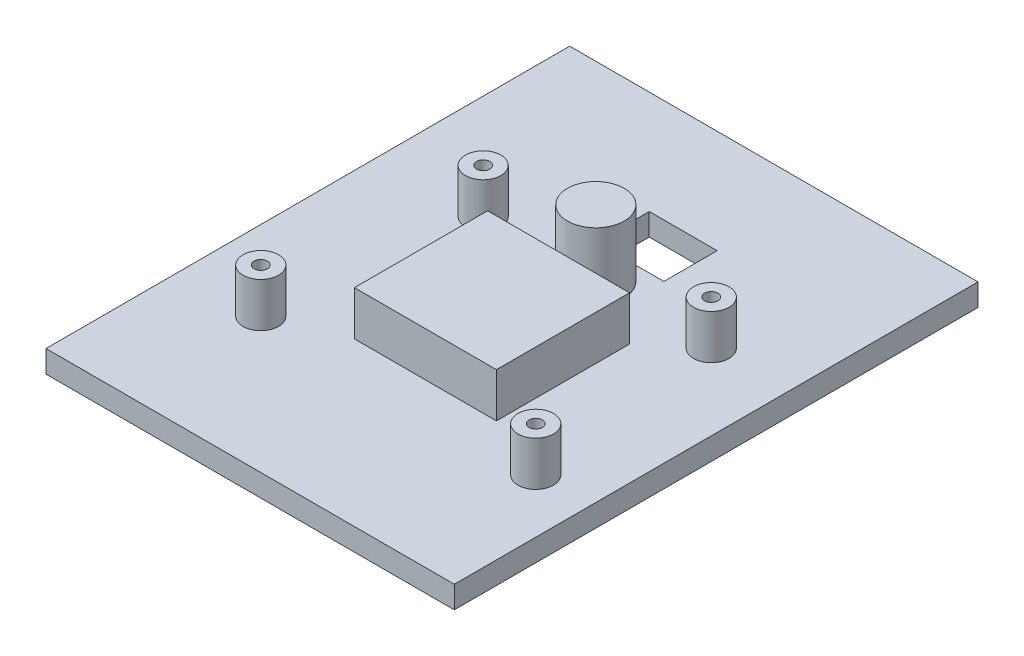
ISO-10303-21;
HEADER;
FILE_DESCRIPTION(('STEP AP214'),'2;1');
FILE_NAME('part.step','',(''),(''),'','','');
FILE_SCHEMA(('AUTOMOTIVE_DESIGN { 1 0 10303 214 1 1 1 1 }'));
ENDSEC;
DATA;
#1=APPLICATION_CONTEXT('core data for automotive mechanical design processes');
#2=APPLICATION_PROTOCOL_DEFINITION('international standard','automotive_design',2000,#1);
#3=PRODUCT_CONTEXT('',#1,'mechanical');
#4=PRODUCT('Part','Part','',(#3));
#5=PRODUCT_RELATED_PRODUCT_CATEGORY('part','',(#4));
#6=PRODUCT_DEFINITION_FORMATION('','',#4);
#7=PRODUCT_DEFINITION_CONTEXT('part definition',#1,'design');
#8=PRODUCT_DEFINITION('design','',#6,#7);
#9=PRODUCT_DEFINITION_SHAPE('','',#8);
#10=(LENGTH_UNIT() NAMED_UNIT(*) SI_UNIT(.MILLI.,.METRE.));
#11=(NAMED_UNIT(*) PLANE_ANGLE_UNIT() SI_UNIT($,.RADIAN.));
#12=(NAMED_UNIT(*) SI_UNIT($,.STERADIAN.) SOLID_ANGLE_UNIT());
#13=UNCERTAINTY_MEASURE_WITH_UNIT(LENGTH_MEASURE(1.E-05),#10,'distance_accuracy_value','');
#14=(GEOMETRIC_REPRESENTATION_CONTEXT(3) GLOBAL_UNCERTAINTY_ASSIGNED_CONTEXT((#13)) GLOBAL_UNIT_ASSIGNED_CONTEXT((#10,
#11,#12)) REPRESENTATION_CONTEXT('',''));
#15=CARTESIAN_POINT('',(0.,0.,0.));
#16=DIRECTION('',(0.,0.,1.));
#17=DIRECTION('',(1.,0.,0.));
#18=AXIS2_PLACEMENT_3D('',#15,#16,#17);
#19=CARTESIAN_POINT('',(-48.875,0.,0.));
#20=DIRECTION('',(1.,0.,0.));
#21=DIRECTION('',(0.,0.,-1.));
#22=AXIS2_PLACEMENT_3D('',#19,#20,#21);
#23=PLANE('',#22);
#24=DIRECTION('',(0.,-1.,0.));
#25=VECTOR('',#24,1.);
#26=CARTESIAN_POINT('',(-48.875,5.,-55.5));
#27=LINE('',#26,#25);
#28=CARTESIAN_POINT('',(-48.875,5.,-55.5));
#29=VERTEX_POINT('',#28);
#30=CARTESIAN_POINT('',(-48.875,0.,-55.5));
#31=VERTEX_POINT('',#30);
#32=EDGE_CURVE('E11',#29,#31,#27,.T.);
#33=ORIENTED_EDGE('',*,*,#32,.T.);
#34=DIRECTION('',(0.,0.,-1.));
#35=VECTOR('',#34,1.);
#36=CARTESIAN_POINT('',(-48.875,0.,0.));
#37=LINE('',#36,#35);
#38=CARTESIAN_POINT('',(-48.875,0.,62.5));
#39=VERTEX_POINT('',#38);
#40=EDGE_CURVE('E49',#39,#31,#37,.T.);
#41=ORIENTED_EDGE('',*,*,#40,.F.);
#42=DIRECTION('',(0.,-1.,0.));
#43=VECTOR('',#42,1.);
#44=CARTESIAN_POINT('',(-48.875,5.,62.5));
#45=LINE('',#44,#43);
#46=CARTESIAN_POINT('',(-48.875,5.,62.5));
#47=VERTEX_POINT('',#46);
#48=EDGE_CURVE('E219',#47,#39,#45,.T.);
#49=ORIENTED_EDGE('',*,*,#48,.F.);
#50=DIRECTION('',(0.,0.,-1.));
#51=VECTOR('',#50,1.);
#52=CARTESIAN_POINT('',(-48.875,5.,0.));
#53=LINE('',#52,#51);
#54=EDGE_CURVE('E42',#47,#29,#53,.T.);
#55=ORIENTED_EDGE('',*,*,#54,.T.);
#56=EDGE_LOOP('',(#33,#41,#49,#55));
#57=FACE_BOUND('',#56,.T.);
#58=ADVANCED_FACE('F35',(#57),#23,.F.);
#59=CARTESIAN_POINT('',(0.,20.,-12.51));
#60=DIRECTION('',(0.,1.,0.));
#61=DIRECTION('',(0.,0.,1.));
#62=AXIS2_PLACEMENT_3D('',#59,#60,#61);
#63=PLANE('',#62);
#64=CARTESIAN_POINT('',(0.,20.,-12.51));
#65=DIRECTION('',(0.,1.,0.));
#66=DIRECTION('',(0.,0.,1.));
#67=AXIS2_PLACEMENT_3D('',#64,#65,#66);
#68=CIRCLE('',#67,6.39);
#69=CARTESIAN_POINT('',(0.,20.,-6.12000000000001));
#70=VERTEX_POINT('',#69);
#71=EDGE_CURVE('E330',#70,#70,#68,.T.);
#72=ORIENTED_EDGE('',*,*,#71,.T.);
#73=EDGE_LOOP('',(#72));
#74=FACE_BOUND('',#73,.T.);
#75=ADVANCED_FACE('F247',(#74),#63,.T.);
#76=CARTESIAN_POINT('',(0.,15.,0.));
#77=DIRECTION('',(0.,1.,0.));
#78=DIRECTION('',(0.,0.,1.));
#79=AXIS2_PLACEMENT_3D('',#76,#77,#78);
#80=PLANE('',#79);
#81=DIRECTION('',(1.,0.,0.));
#82=VECTOR('',#81,1.);
#83=CARTESIAN_POINT('',(0.,15.,25.88));
#84=LINE('',#83,#82);
#85=CARTESIAN_POINT('',(-16.,15.,25.88));
#86=VERTEX_POINT('',#85);
#87=CARTESIAN_POINT('',(16.,15.,25.88));
#88=VERTEX_POINT('',#87);
#89=EDGE_CURVE('E135',#86,#88,#84,.T.);
#90=ORIENTED_EDGE('',*,*,#89,.T.);
#91=DIRECTION('',(0.,0.,-1.));
#92=VECTOR('',#91,1.);
#93=CARTESIAN_POINT('',(16.,15.,0.));
#94=LINE('',#93,#92);
#95=CARTESIAN_POINT('',(16.,15.,-4.12000000000001));
#96=VERTEX_POINT('',#95);
#97=EDGE_CURVE('E122',#88,#96,#94,.T.);
#98=ORIENTED_EDGE('',*,*,#97,.T.);
#99=DIRECTION('',(1.,0.,0.));
#100=VECTOR('',#99,1.);
#101=CARTESIAN_POINT('',(0.,15.,-4.12000000000001));
#102=LINE('',#101,#100);
#103=CARTESIAN_POINT('',(-16.,15.,-4.12000000000001));
#104=VERTEX_POINT('',#103);
#105=EDGE_CURVE('E134',#104,#96,#102,.T.);
#106=ORIENTED_EDGE('',*,*,#105,.F.);
#107=DIRECTION('',(0.,0.,-1.));
#108=VECTOR('',#107,1.);
#109=CARTESIAN_POINT('',(-16.,15.,0.));
#110=LINE('',#109,#108);
#111=EDGE_CURVE('E141',#86,#104,#110,.T.);
#112=ORIENTED_EDGE('',*,*,#111,.F.);
#113=EDGE_LOOP('',(#90,#98,#106,#112));
#114=FACE_BOUND('',#113,.T.);
#115=ADVANCED_FACE('F139',(#114),#80,.T.);
#116=CARTESIAN_POINT('',(0.,15.,0.));
#117=DIRECTION('',(0.,1.,0.));
#118=DIRECTION('',(0.,0.,1.));
#119=AXIS2_PLACEMENT_3D('',#116,#117,#118);
#120=PLANE('',#119);
#121=CARTESIAN_POINT('',(30.975,15.,32.));
#122=DIRECTION('',(0.,1.,0.));
#123=DIRECTION('',(0.,0.,1.));
#124=AXIS2_PLACEMENT_3D('',#121,#122,#123);
#125=CIRCLE('',#124,1.50000000000001);
#126=CARTESIAN_POINT('',(30.975,15.,33.5));
#127=VERTEX_POINT('',#126);
#128=EDGE_CURVE('E378',#127,#127,#125,.F.);
#129=ORIENTED_EDGE('',*,*,#128,.T.);
#130=EDGE_LOOP('',(#129));
#131=FACE_BOUND('',#130,.T.);
#132=CARTESIAN_POINT('',(30.975,15.,32.));
#133=DIRECTION('',(0.,1.,0.));
#134=DIRECTION('',(0.,0.,1.));
#135=AXIS2_PLACEMENT_3D('',#132,#133,#134);
#136=CIRCLE('',#135,4.);
#137=CARTESIAN_POINT('',(30.975,15.,36.));
#138=VERTEX_POINT('',#137);
#139=EDGE_CURVE('E381',#138,#138,#136,.T.);
#140=ORIENTED_EDGE('',*,*,#139,.T.);
#141=EDGE_LOOP('',(#140));
#142=FACE_BOUND('',#141,.T.);
#143=ADVANCED_FACE('F256',(#131,#142),#120,.T.);
#144=CARTESIAN_POINT('',(0.,15.,0.));
#145=DIRECTION('',(0.,1.,0.));
#146=DIRECTION('',(0.,0.,1.));
#147=AXIS2_PLACEMENT_3D('',#144,#145,#146);
#148=PLANE('',#147);
#149=CARTESIAN_POINT('',(-25.375,15.,-12.5));
#150=DIRECTION('',(0.,1.,0.));
#151=DIRECTION('',(0.,0.,1.));
#152=AXIS2_PLACEMENT_3D('',#149,#150,#151);
#153=CIRCLE('',#152,1.5);
#154=CARTESIAN_POINT('',(-25.375,15.,-11.));
#155=VERTEX_POINT('',#154);
#156=EDGE_CURVE('E324',#155,#155,#153,.F.);
#157=ORIENTED_EDGE('',*,*,#156,.T.);
#158=EDGE_LOOP('',(#157));
#159=FACE_BOUND('',#158,.T.);
#160=CARTESIAN_POINT('',(-25.375,15.,-12.5));
#161=DIRECTION('',(0.,1.,0.));
#162=DIRECTION('',(0.,0.,1.));
#163=AXIS2_PLACEMENT_3D('',#160,#161,#162);
#164=CIRCLE('',#163,4.);
#165=CARTESIAN_POINT('',(-25.375,15.,-8.5));
#166=VERTEX_POINT('',#165);
#167=EDGE_CURVE('E326',#166,#166,#164,.T.);
#168=ORIENTED_EDGE('',*,*,#167,.T.);
#169=EDGE_LOOP('',(#168));
#170=FACE_BOUND('',#169,.T.);
#171=ADVANCED_FACE('F406',(#159,#170),#148,.T.);
#172=CARTESIAN_POINT('',(0.,15.,0.));
#173=DIRECTION('',(0.,1.,0.));
#174=DIRECTION('',(0.,0.,1.));
#175=AXIS2_PLACEMENT_3D('',#172,#173,#174);
#176=PLANE('',#175);
#177=CARTESIAN_POINT('',(26.025,15.,-12.5));
#178=DIRECTION('',(0.,1.,0.));
#179=DIRECTION('',(0.,0.,1.));
#180=AXIS2_PLACEMENT_3D('',#177,#178,#179);
#181=CIRCLE('',#180,1.5);
#182=CARTESIAN_POINT('',(26.025,15.,-11.));
#183=VERTEX_POINT('',#182);
#184=EDGE_CURVE('E385',#183,#183,#181,.F.);
#185=ORIENTED_EDGE('',*,*,#184,.T.);
#186=EDGE_LOOP('',(#185));
#187=FACE_BOUND('',#186,.T.);
#188=CARTESIAN_POINT('',(26.025,15.,-12.5));
#189=DIRECTION('',(0.,1.,0.));
#190=DIRECTION('',(0.,0.,1.));
#191=AXIS2_PLACEMENT_3D('',#188,#189,#190);
#192=CIRCLE('',#191,4.);
#193=CARTESIAN_POINT('',(26.025,15.,-8.5));
#194=VERTEX_POINT('',#193);
#195=EDGE_CURVE('E333',#194,#194,#192,.T.);
#196=ORIENTED_EDGE('',*,*,#195,.T.);
#197=EDGE_LOOP('',(#196));
#198=FACE_BOUND('',#197,.T.);
#199=ADVANCED_FACE('F390',(#187,#198),#176,.T.);
#200=CARTESIAN_POINT('',(0.,15.,0.));
#201=DIRECTION('',(0.,1.,0.));
#202=DIRECTION('',(0.,0.,1.));
#203=AXIS2_PLACEMENT_3D('',#200,#201,#202);
#204=PLANE('',#203);
#205=CARTESIAN_POINT('',(-30.975,15.,32.));
#206=DIRECTION('',(0.,1.,0.));
#207=DIRECTION('',(0.,0.,1.));
#208=AXIS2_PLACEMENT_3D('',#205,#206,#207);
#209=CIRCLE('',#208,1.5);
#210=CARTESIAN_POINT('',(-30.975,15.,33.5));
#211=VERTEX_POINT('',#210);
#212=EDGE_CURVE('E371',#211,#211,#209,.F.);
#213=ORIENTED_EDGE('',*,*,#212,.T.);
#214=EDGE_LOOP('',(#213));
#215=FACE_BOUND('',#214,.T.);
#216=CARTESIAN_POINT('',(-30.975,15.,32.));
#217=DIRECTION('',(0.,1.,0.));
#218=DIRECTION('',(0.,0.,1.));
#219=AXIS2_PLACEMENT_3D('',#216,#217,#218);
#220=CIRCLE('',#219,4.);
#221=CARTESIAN_POINT('',(-30.975,15.,36.));
#222=VERTEX_POINT('',#221);
#223=EDGE_CURVE('E374',#222,#222,#220,.T.);
#224=ORIENTED_EDGE('',*,*,#223,.T.);
#225=EDGE_LOOP('',(#224));
#226=FACE_BOUND('',#225,.T.);
#227=ADVANCED_FACE('F412',(#215,#226),#204,.T.);
#228=CARTESIAN_POINT('',(-30.975,15.,32.));
#229=DIRECTION('',(0.,-1.,0.));
#230=DIRECTION('',(0.,0.,-1.));
#231=AXIS2_PLACEMENT_3D('',#228,#229,#230);
#232=CYLINDRICAL_SURFACE('',#231,4.);
#233=ORIENTED_EDGE('',*,*,#223,.F.);
#234=EDGE_LOOP('',(#233));
#235=FACE_BOUND('',#234,.T.);
#236=CARTESIAN_POINT('',(-30.975,5.,32.));
#237=DIRECTION('',(0.,1.,0.));
#238=DIRECTION('',(0.,0.,1.));
#239=AXIS2_PLACEMENT_3D('',#236,#237,#238);
#240=CIRCLE('',#239,4.);
#241=CARTESIAN_POINT('',(-30.975,5.,36.));
#242=VERTEX_POINT('',#241);
#243=EDGE_CURVE('E369',#242,#242,#240,.T.);
#244=ORIENTED_EDGE('',*,*,#243,.T.);
#245=EDGE_LOOP('',(#244));
#246=FACE_BOUND('',#245,.T.);
#247=ADVANCED_FACE('F402',(#235,#246),#232,.T.);
#248=CARTESIAN_POINT('',(30.975,15.,32.));
#249=DIRECTION('',(0.,-1.,0.));
#250=DIRECTION('',(0.,0.,-1.));
#251=AXIS2_PLACEMENT_3D('',#248,#249,#250);
#252=CYLINDRICAL_SURFACE('',#251,4.);
#253=ORIENTED_EDGE('',*,*,#139,.F.);
#254=EDGE_LOOP('',(#253));
#255=FACE_BOUND('',#254,.T.);
#256=CARTESIAN_POINT('',(30.975,5.,32.));
#257=DIRECTION('',(0.,1.,0.));
#258=DIRECTION('',(0.,0.,1.));
#259=AXIS2_PLACEMENT_3D('',#256,#257,#258);
#260=CIRCLE('',#259,4.);
#261=CARTESIAN_POINT('',(30.975,5.,36.));
#262=VERTEX_POINT('',#261);
#263=EDGE_CURVE('E366',#262,#262,#260,.T.);
#264=ORIENTED_EDGE('',*,*,#263,.T.);
#265=EDGE_LOOP('',(#264));
#266=FACE_BOUND('',#265,.T.);
#267=ADVANCED_FACE('F395',(#255,#266),#252,.T.);
#268=CARTESIAN_POINT('',(26.025,15.,-12.5));
#269=DIRECTION('',(0.,-1.,0.));
#270=DIRECTION('',(0.,0.,-1.));
#271=AXIS2_PLACEMENT_3D('',#268,#269,#270);
#272=CYLINDRICAL_SURFACE('',#271,4.);
#273=ORIENTED_EDGE('',*,*,#195,.F.);
#274=EDGE_LOOP('',(#273));
#275=FACE_BOUND('',#274,.T.);
#276=CARTESIAN_POINT('',(26.025,5.,-12.5));
#277=DIRECTION('',(0.,1.,0.));
#278=DIRECTION('',(0.,0.,1.));
#279=AXIS2_PLACEMENT_3D('',#276,#277,#278);
#280=CIRCLE('',#279,4.);
#281=CARTESIAN_POINT('',(26.025,5.,-8.5));
#282=VERTEX_POINT('',#281);
#283=EDGE_CURVE('E336',#282,#282,#280,.T.);
#284=ORIENTED_EDGE('',*,*,#283,.T.);
#285=EDGE_LOOP('',(#284));
#286=FACE_BOUND('',#285,.T.);
#287=ADVANCED_FACE('F392',(#275,#286),#272,.T.);
#288=CARTESIAN_POINT('',(-25.375,15.,-12.5));
#289=DIRECTION('',(0.,-1.,0.));
#290=DIRECTION('',(0.,0.,-1.));
#291=AXIS2_PLACEMENT_3D('',#288,#289,#290);
#292=CYLINDRICAL_SURFACE('',#291,4.);
#293=ORIENTED_EDGE('',*,*,#167,.F.);
#294=EDGE_LOOP('',(#293));
#295=FACE_BOUND('',#294,.T.);
#296=CARTESIAN_POINT('',(-25.375,5.,-12.5));
#297=DIRECTION('',(0.,1.,0.));
#298=DIRECTION('',(0.,0.,1.));
#299=AXIS2_PLACEMENT_3D('',#296,#297,#298);
#300=CIRCLE('',#299,4.);
#301=CARTESIAN_POINT('',(-25.375,5.,-8.5));
#302=VERTEX_POINT('',#301);
#303=EDGE_CURVE('E327',#302,#302,#300,.T.);
#304=ORIENTED_EDGE('',*,*,#303,.T.);
#305=EDGE_LOOP('',(#304));
#306=FACE_BOUND('',#305,.T.);
#307=ADVANCED_FACE('F261',(#295,#306),#292,.T.);
#308=CARTESIAN_POINT('',(0.,0.,-12.51));
#309=DIRECTION('',(0.,1.,0.));
#310=DIRECTION('',(0.,0.,1.));
#311=AXIS2_PLACEMENT_3D('',#308,#309,#310);
#312=CYLINDRICAL_SURFACE('',#311,6.39);
#313=CARTESIAN_POINT('',(0.,5.,-12.51));
#314=DIRECTION('',(0.,1.,0.));
#315=DIRECTION('',(0.,0.,1.));
#316=AXIS2_PLACEMENT_3D('',#313,#314,#315);
#317=CIRCLE('',#316,6.39);
#318=CARTESIAN_POINT('',(0.,5.,-6.12000000000001));
#319=VERTEX_POINT('',#318);
#320=EDGE_CURVE('E175',#319,#319,#317,.T.);
#321=ORIENTED_EDGE('',*,*,#320,.T.);
#322=EDGE_LOOP('',(#321));
#323=FACE_BOUND('',#322,.T.);
#324=ORIENTED_EDGE('',*,*,#71,.F.);
#325=EDGE_LOOP('',(#324));
#326=FACE_BOUND('',#325,.T.);
#327=ADVANCED_FACE('F263',(#323,#326),#312,.T.);
#328=CARTESIAN_POINT('',(0.,15.,-4.12000000000001));
#329=DIRECTION('',(0.,0.,-1.));
#330=DIRECTION('',(-1.,0.,0.));
#331=AXIS2_PLACEMENT_3D('',#328,#329,#330);
#332=PLANE('',#331);
#333=DIRECTION('',(1.,0.,0.));
#334=VECTOR('',#333,1.);
#335=CARTESIAN_POINT('',(0.,5.,-4.12000000000001));
#336=LINE('',#335,#334);
#337=CARTESIAN_POINT('',(-16.,5.,-4.12000000000001));
#338=VERTEX_POINT('',#337);
#339=CARTESIAN_POINT('',(16.,5.,-4.12000000000001));
#340=VERTEX_POINT('',#339);
#341=EDGE_CURVE('E346',#338,#340,#336,.T.);
#342=ORIENTED_EDGE('',*,*,#341,.F.);
#343=DIRECTION('',(0.,-1.,0.));
#344=VECTOR('',#343,1.);
#345=CARTESIAN_POINT('',(-16.,15.,-4.12000000000001));
#346=LINE('',#345,#344);
#347=EDGE_CURVE('E153',#104,#338,#346,.T.);
#348=ORIENTED_EDGE('',*,*,#347,.F.);
#349=ORIENTED_EDGE('',*,*,#105,.T.);
#350=DIRECTION('',(0.,-1.,0.));
#351=VECTOR('',#350,1.);
#352=CARTESIAN_POINT('',(16.,15.,-4.12000000000001));
#353=LINE('',#352,#351);
#354=EDGE_CURVE('E130',#96,#340,#353,.T.);
#355=ORIENTED_EDGE('',*,*,#354,.T.);
#356=EDGE_LOOP('',(#342,#348,#349,#355));
#357=FACE_BOUND('',#356,.T.);
#358=ADVANCED_FACE('F265',(#357),#332,.T.);
#359=CARTESIAN_POINT('',(-16.,15.,0.));
#360=DIRECTION('',(-1.,0.,0.));
#361=DIRECTION('',(0.,0.,1.));
#362=AXIS2_PLACEMENT_3D('',#359,#360,#361);
#363=PLANE('',#362);
#364=DIRECTION('',(0.,0.,-1.));
#365=VECTOR('',#364,1.);
#366=CARTESIAN_POINT('',(-16.,5.,0.));
#367=LINE('',#366,#365);
#368=CARTESIAN_POINT('',(-16.,5.,25.88));
#369=VERTEX_POINT('',#368);
#370=EDGE_CURVE('E144',#369,#338,#367,.T.);
#371=ORIENTED_EDGE('',*,*,#370,.F.);
#372=DIRECTION('',(0.,-1.,0.));
#373=VECTOR('',#372,1.);
#374=CARTESIAN_POINT('',(-16.,15.,25.88));
#375=LINE('',#374,#373);
#376=EDGE_CURVE('E342',#86,#369,#375,.T.);
#377=ORIENTED_EDGE('',*,*,#376,.F.);
#378=ORIENTED_EDGE('',*,*,#111,.T.);
#379=ORIENTED_EDGE('',*,*,#347,.T.);
#380=EDGE_LOOP('',(#371,#377,#378,#379));
#381=FACE_BOUND('',#380,.T.);
#382=ADVANCED_FACE('F268',(#381),#363,.T.);
#383=CARTESIAN_POINT('',(0.,15.,25.88));
#384=DIRECTION('',(0.,0.,-1.));
#385=DIRECTION('',(-1.,0.,0.));
#386=AXIS2_PLACEMENT_3D('',#383,#384,#385);
#387=PLANE('',#386);
#388=DIRECTION('',(1.,0.,0.));
#389=VECTOR('',#388,1.);
#390=CARTESIAN_POINT('',(0.,5.,25.88));
#391=LINE('',#390,#389);
#392=CARTESIAN_POINT('',(16.,5.,25.88));
#393=VERTEX_POINT('',#392);
#394=EDGE_CURVE('E147',#369,#393,#391,.T.);
#395=ORIENTED_EDGE('',*,*,#394,.T.);
#396=DIRECTION('',(0.,-1.,0.));
#397=VECTOR('',#396,1.);
#398=CARTESIAN_POINT('',(16.,15.,25.88));
#399=LINE('',#398,#397);
#400=EDGE_CURVE('E127',#88,#393,#399,.T.);
#401=ORIENTED_EDGE('',*,*,#400,.F.);
#402=ORIENTED_EDGE('',*,*,#89,.F.);
#403=ORIENTED_EDGE('',*,*,#376,.T.);
#404=EDGE_LOOP('',(#395,#401,#402,#403));
#405=FACE_BOUND('',#404,.T.);
#406=ADVANCED_FACE('F146',(#405),#387,.F.);
#407=CARTESIAN_POINT('',(16.,15.,0.));
#408=DIRECTION('',(-1.,0.,0.));
#409=DIRECTION('',(0.,0.,1.));
#410=AXIS2_PLACEMENT_3D('',#407,#408,#409);
#411=PLANE('',#410);
#412=DIRECTION('',(0.,0.,-1.));
#413=VECTOR('',#412,1.);
#414=CARTESIAN_POINT('',(16.,5.,0.));
#415=LINE('',#414,#413);
#416=EDGE_CURVE('E344',#393,#340,#415,.T.);
#417=ORIENTED_EDGE('',*,*,#416,.T.);
#418=ORIENTED_EDGE('',*,*,#354,.F.);
#419=ORIENTED_EDGE('',*,*,#97,.F.);
#420=ORIENTED_EDGE('',*,*,#400,.T.);
#421=EDGE_LOOP('',(#417,#418,#419,#420));
#422=FACE_BOUND('',#421,.T.);
#423=ADVANCED_FACE('F125',(#422),#411,.F.);
#424=CARTESIAN_POINT('',(30.975,5.,32.));
#425=DIRECTION('',(0.,-1.,0.));
#426=DIRECTION('',(0.,0.,-1.));
#427=AXIS2_PLACEMENT_3D('',#424,#425,#426);
#428=CYLINDRICAL_SURFACE('',#427,1.50000000000001);
#429=CARTESIAN_POINT('',(30.975,0.,32.));
#430=DIRECTION('',(0.,1.,0.));
#431=DIRECTION('',(0.,0.,1.));
#432=AXIS2_PLACEMENT_3D('',#429,#430,#431);
#433=CIRCLE('',#432,1.50000000000001);
#434=CARTESIAN_POINT('',(30.975,0.,33.5));
#435=VERTEX_POINT('',#434);
#436=EDGE_CURVE('E192',#435,#435,#433,.T.);
#437=ORIENTED_EDGE('',*,*,#436,.F.);
#438=EDGE_LOOP('',(#437));
#439=FACE_BOUND('',#438,.T.);
#440=ORIENTED_EDGE('',*,*,#128,.F.);
#441=EDGE_LOOP('',(#440));
#442=FACE_BOUND('',#441,.T.);
#443=ADVANCED_FACE('F277',(#439,#442),#428,.F.);
#444=CARTESIAN_POINT('',(-25.375,5.,-12.5));
#445=DIRECTION('',(0.,-1.,0.));
#446=DIRECTION('',(0.,0.,-1.));
#447=AXIS2_PLACEMENT_3D('',#444,#445,#446);
#448=CYLINDRICAL_SURFACE('',#447,1.5);
#449=CARTESIAN_POINT('',(-25.375,0.,-12.5));
#450=DIRECTION('',(0.,1.,0.));
#451=DIRECTION('',(0.,0.,1.));
#452=AXIS2_PLACEMENT_3D('',#449,#450,#451);
#453=CIRCLE('',#452,1.5);
#454=CARTESIAN_POINT('',(-25.375,0.,-11.));
#455=VERTEX_POINT('',#454);
#456=EDGE_CURVE('E168',#455,#455,#453,.T.);
#457=ORIENTED_EDGE('',*,*,#456,.F.);
#458=EDGE_LOOP('',(#457));
#459=FACE_BOUND('',#458,.T.);
#460=ORIENTED_EDGE('',*,*,#156,.F.);
#461=EDGE_LOOP('',(#460));
#462=FACE_BOUND('',#461,.T.);
#463=ADVANCED_FACE('F312',(#459,#462),#448,.F.);
#464=CARTESIAN_POINT('',(26.025,5.,-12.5));
#465=DIRECTION('',(0.,-1.,0.));
#466=DIRECTION('',(0.,0.,-1.));
#467=AXIS2_PLACEMENT_3D('',#464,#465,#466);
#468=CYLINDRICAL_SURFACE('',#467,1.5);
#469=CARTESIAN_POINT('',(26.025,0.,-12.5));
#470=DIRECTION('',(0.,1.,0.));
#471=DIRECTION('',(0.,0.,1.));
#472=AXIS2_PLACEMENT_3D('',#469,#470,#471);
#473=CIRCLE('',#472,1.5);
#474=CARTESIAN_POINT('',(26.025,0.,-11.));
#475=VERTEX_POINT('',#474);
#476=EDGE_CURVE('E189',#475,#475,#473,.T.);
#477=ORIENTED_EDGE('',*,*,#476,.F.);
#478=EDGE_LOOP('',(#477));
#479=FACE_BOUND('',#478,.T.);
#480=ORIENTED_EDGE('',*,*,#184,.F.);
#481=EDGE_LOOP('',(#480));
#482=FACE_BOUND('',#481,.T.);
#483=ADVANCED_FACE('F308',(#479,#482),#468,.F.);
#484=CARTESIAN_POINT('',(-30.975,5.,32.));
#485=DIRECTION('',(0.,-1.,0.));
#486=DIRECTION('',(0.,0.,-1.));
#487=AXIS2_PLACEMENT_3D('',#484,#485,#486);
#488=CYLINDRICAL_SURFACE('',#487,1.5);
#489=CARTESIAN_POINT('',(-30.975,0.,32.));
#490=DIRECTION('',(0.,1.,0.));
#491=DIRECTION('',(0.,0.,1.));
#492=AXIS2_PLACEMENT_3D('',#489,#490,#491);
#493=CIRCLE('',#492,1.5);
#494=CARTESIAN_POINT('',(-30.975,0.,33.5));
#495=VERTEX_POINT('',#494);
#496=EDGE_CURVE('E195',#495,#495,#493,.T.);
#497=ORIENTED_EDGE('',*,*,#496,.F.);
#498=EDGE_LOOP('',(#497));
#499=FACE_BOUND('',#498,.T.);
#500=ORIENTED_EDGE('',*,*,#212,.F.);
#501=EDGE_LOOP('',(#500));
#502=FACE_BOUND('',#501,.T.);
#503=ADVANCED_FACE('F284',(#499,#502),#488,.F.);
#504=CARTESIAN_POINT('',(7.64999999999999,-1.,0.));
#505=DIRECTION('',(1.,0.,0.));
#506=DIRECTION('',(0.,0.,-1.));
#507=AXIS2_PLACEMENT_3D('',#504,#505,#506);
#508=PLANE('',#507);
#509=DIRECTION('',(0.,1.,0.));
#510=VECTOR('',#509,1.);
#511=CARTESIAN_POINT('',(7.64999999999999,-1.,-20.2));
#512=LINE('',#511,#510);
#513=CARTESIAN_POINT('',(7.64999999999999,0.,-20.2));
#514=VERTEX_POINT('',#513);
#515=CARTESIAN_POINT('',(7.64999999999999,5.,-20.2));
#516=VERTEX_POINT('',#515);
#517=EDGE_CURVE('E169',#514,#516,#512,.T.);
#518=ORIENTED_EDGE('',*,*,#517,.T.);
#519=DIRECTION('',(0.,0.,-1.));
#520=VECTOR('',#519,1.);
#521=CARTESIAN_POINT('',(7.64999999999999,5.,0.));
#522=LINE('',#521,#520);
#523=CARTESIAN_POINT('',(7.64999999999999,5.,-32.2));
#524=VERTEX_POINT('',#523);
#525=EDGE_CURVE('E162',#516,#524,#522,.T.);
#526=ORIENTED_EDGE('',*,*,#525,.T.);
#527=DIRECTION('',(0.,1.,0.));
#528=VECTOR('',#527,1.);
#529=CARTESIAN_POINT('',(7.64999999999999,-1.,-32.2));
#530=LINE('',#529,#528);
#531=CARTESIAN_POINT('',(7.64999999999999,0.,-32.2));
#532=VERTEX_POINT('',#531);
#533=EDGE_CURVE('E166',#532,#524,#530,.T.);
#534=ORIENTED_EDGE('',*,*,#533,.F.);
#535=DIRECTION('',(0.,0.,-1.));
#536=VECTOR('',#535,1.);
#537=CARTESIAN_POINT('',(7.64999999999999,0.,0.));
#538=LINE('',#537,#536);
#539=EDGE_CURVE('E214',#514,#532,#538,.T.);
#540=ORIENTED_EDGE('',*,*,#539,.F.);
#541=EDGE_LOOP('',(#518,#526,#534,#540));
#542=FACE_BOUND('',#541,.T.);
#543=ADVANCED_FACE('F280',(#542),#508,.F.);
#544=CARTESIAN_POINT('',(0.,-1.,-20.2));
#545=DIRECTION('',(0.,0.,1.));
#546=DIRECTION('',(1.,0.,0.));
#547=AXIS2_PLACEMENT_3D('',#544,#545,#546);
#548=PLANE('',#547);
#549=DIRECTION('',(0.,1.,0.));
#550=VECTOR('',#549,1.);
#551=CARTESIAN_POINT('',(-7.65000000000001,-1.,-20.2));
#552=LINE('',#551,#550);
#553=CARTESIAN_POINT('',(-7.65000000000001,0.,-20.2));
#554=VERTEX_POINT('',#553);
#555=CARTESIAN_POINT('',(-7.65000000000001,5.,-20.2));
#556=VERTEX_POINT('',#555);
#557=EDGE_CURVE('E171',#554,#556,#552,.T.);
#558=ORIENTED_EDGE('',*,*,#557,.T.);
#559=DIRECTION('',(1.,0.,0.));
#560=VECTOR('',#559,1.);
#561=CARTESIAN_POINT('',(0.,5.,-20.2));
#562=LINE('',#561,#560);
#563=EDGE_CURVE('E159',#556,#516,#562,.T.);
#564=ORIENTED_EDGE('',*,*,#563,.T.);
#565=ORIENTED_EDGE('',*,*,#517,.F.);
#566=DIRECTION('',(1.,0.,0.));
#567=VECTOR('',#566,1.);
#568=CARTESIAN_POINT('',(0.,0.,-20.2));
#569=LINE('',#568,#567);
#570=EDGE_CURVE('E211',#554,#514,#569,.T.);
#571=ORIENTED_EDGE('',*,*,#570,.F.);
#572=EDGE_LOOP('',(#558,#564,#565,#571));
#573=FACE_BOUND('',#572,.T.);
#574=ADVANCED_FACE('F283',(#573),#548,.F.);
#575=CARTESIAN_POINT('',(-7.65000000000001,-1.,0.));
#576=DIRECTION('',(1.,0.,0.));
#577=DIRECTION('',(0.,0.,-1.));
#578=AXIS2_PLACEMENT_3D('',#575,#576,#577);
#579=PLANE('',#578);
#580=DIRECTION('',(0.,0.,-1.));
#581=VECTOR('',#580,1.);
#582=CARTESIAN_POINT('',(-7.65000000000001,0.,0.));
#583=LINE('',#582,#581);
#584=CARTESIAN_POINT('',(-7.65000000000001,0.,-32.2));
#585=VERTEX_POINT('',#584);
#586=EDGE_CURVE('E209',#554,#585,#583,.T.);
#587=ORIENTED_EDGE('',*,*,#586,.T.);
#588=DIRECTION('',(0.,1.,0.));
#589=VECTOR('',#588,1.);
#590=CARTESIAN_POINT('',(-7.65000000000001,-1.,-32.2));
#591=LINE('',#590,#589);
#592=CARTESIAN_POINT('',(-7.65000000000001,5.,-32.2));
#593=VERTEX_POINT('',#592);
#594=EDGE_CURVE('E165',#585,#593,#591,.T.);
#595=ORIENTED_EDGE('',*,*,#594,.T.);
#596=DIRECTION('',(0.,0.,-1.));
#597=VECTOR('',#596,1.);
#598=CARTESIAN_POINT('',(-7.65000000000001,5.,0.));
#599=LINE('',#598,#597);
#600=EDGE_CURVE('E151',#556,#593,#599,.T.);
#601=ORIENTED_EDGE('',*,*,#600,.F.);
#602=ORIENTED_EDGE('',*,*,#557,.F.);
#603=EDGE_LOOP('',(#587,#595,#601,#602));
#604=FACE_BOUND('',#603,.T.);
#605=ADVANCED_FACE('F288',(#604),#579,.T.);
#606=CARTESIAN_POINT('',(0.,-1.,-32.2));
#607=DIRECTION('',(0.,0.,1.));
#608=DIRECTION('',(1.,0.,0.));
#609=AXIS2_PLACEMENT_3D('',#606,#607,#608);
#610=PLANE('',#609);
#611=DIRECTION('',(1.,0.,0.));
#612=VECTOR('',#611,1.);
#613=CARTESIAN_POINT('',(0.,0.,-32.2));
#614=LINE('',#613,#612);
#615=EDGE_CURVE('E217',#585,#532,#614,.T.);
#616=ORIENTED_EDGE('',*,*,#615,.T.);
#617=ORIENTED_EDGE('',*,*,#533,.T.);
#618=DIRECTION('',(1.,0.,0.));
#619=VECTOR('',#618,1.);
#620=CARTESIAN_POINT('',(0.,5.,-32.2));
#621=LINE('',#620,#619);
#622=EDGE_CURVE('E148',#593,#524,#621,.T.);
#623=ORIENTED_EDGE('',*,*,#622,.F.);
#624=ORIENTED_EDGE('',*,*,#594,.F.);
#625=EDGE_LOOP('',(#616,#617,#623,#624));
#626=FACE_BOUND('',#625,.T.);
#627=ADVANCED_FACE('F292',(#626),#610,.T.);
#628=CARTESIAN_POINT('',(43.125,5.,0.));
#629=DIRECTION('',(1.,0.,0.));
#630=DIRECTION('',(0.,0.,-1.));
#631=AXIS2_PLACEMENT_3D('',#628,#629,#630);
#632=PLANE('',#631);
#633=DIRECTION('',(0.,0.,1.));
#634=VECTOR('',#633,1.);
#635=CARTESIAN_POINT('',(43.125,0.,0.));
#636=LINE('',#635,#634);
#637=CARTESIAN_POINT('',(43.125,0.,-55.5));
#638=VERTEX_POINT('',#637);
#639=CARTESIAN_POINT('',(43.125,0.,62.5));
#640=VERTEX_POINT('',#639);
#641=EDGE_CURVE('E198',#638,#640,#636,.T.);
#642=ORIENTED_EDGE('',*,*,#641,.F.);
#643=DIRECTION('',(0.,-1.,0.));
#644=VECTOR('',#643,1.);
#645=CARTESIAN_POINT('',(43.125,5.,-55.5));
#646=LINE('',#645,#644);
#647=CARTESIAN_POINT('',(43.125,5.,-55.5));
#648=VERTEX_POINT('',#647);
#649=EDGE_CURVE('E206',#648,#638,#646,.T.);
#650=ORIENTED_EDGE('',*,*,#649,.F.);
#651=DIRECTION('',(0.,0.,1.));
#652=VECTOR('',#651,1.);
#653=CARTESIAN_POINT('',(43.125,5.,0.));
#654=LINE('',#653,#652);
#655=CARTESIAN_POINT('',(43.125,5.,62.5));
#656=VERTEX_POINT('',#655);
#657=EDGE_CURVE('E178',#648,#656,#654,.T.);
#658=ORIENTED_EDGE('',*,*,#657,.T.);
#659=DIRECTION('',(0.,-1.,0.));
#660=VECTOR('',#659,1.);
#661=CARTESIAN_POINT('',(43.125,5.,62.5));
#662=LINE('',#661,#660);
#663=EDGE_CURVE('E186',#656,#640,#662,.T.);
#664=ORIENTED_EDGE('',*,*,#663,.T.);
#665=EDGE_LOOP('',(#642,#650,#658,#664));
#666=FACE_BOUND('',#665,.T.);
#667=ADVANCED_FACE('F231',(#666),#632,.T.);
#668=CARTESIAN_POINT('',(0.,0.,0.));
#669=DIRECTION('',(0.,1.,0.));
#670=DIRECTION('',(0.,0.,1.));
#671=AXIS2_PLACEMENT_3D('',#668,#669,#670);
#672=PLANE('',#671);
#673=DIRECTION('',(1.,0.,0.));
#674=VECTOR('',#673,1.);
#675=CARTESIAN_POINT('',(0.,0.,62.5));
#676=LINE('',#675,#674);
#677=EDGE_CURVE('E179',#39,#640,#676,.T.);
#678=ORIENTED_EDGE('',*,*,#677,.F.);
#679=ORIENTED_EDGE('',*,*,#40,.T.);
#680=DIRECTION('',(1.,0.,0.));
#681=VECTOR('',#680,1.);
#682=CARTESIAN_POINT('',(0.,0.,-55.5));
#683=LINE('',#682,#681);
#684=EDGE_CURVE('E201',#31,#638,#683,.T.);
#685=ORIENTED_EDGE('',*,*,#684,.T.);
#686=ORIENTED_EDGE('',*,*,#641,.T.);
#687=EDGE_LOOP('',(#678,#679,#685,#686));
#688=FACE_BOUND('',#687,.T.);
#689=ORIENTED_EDGE('',*,*,#615,.F.);
#690=ORIENTED_EDGE('',*,*,#586,.F.);
#691=ORIENTED_EDGE('',*,*,#570,.T.);
#692=ORIENTED_EDGE('',*,*,#539,.T.);
#693=EDGE_LOOP('',(#689,#690,#691,#692));
#694=FACE_BOUND('',#693,.T.);
#695=ORIENTED_EDGE('',*,*,#496,.T.);
#696=EDGE_LOOP('',(#695));
#697=FACE_BOUND('',#696,.T.);
#698=ORIENTED_EDGE('',*,*,#476,.T.);
#699=EDGE_LOOP('',(#698));
#700=FACE_BOUND('',#699,.T.);
#701=ORIENTED_EDGE('',*,*,#456,.T.);
#702=EDGE_LOOP('',(#701));
#703=FACE_BOUND('',#702,.T.);
#704=ORIENTED_EDGE('',*,*,#436,.T.);
#705=EDGE_LOOP('',(#704));
#706=FACE_BOUND('',#705,.T.);
#707=ADVANCED_FACE('F226',(#688,#694,#697,#700,#703,#706),#672,.F.);
#708=CARTESIAN_POINT('',(0.,5.,0.));
#709=DIRECTION('',(0.,1.,0.));
#710=DIRECTION('',(0.,0.,1.));
#711=AXIS2_PLACEMENT_3D('',#708,#709,#710);
#712=PLANE('',#711);
#713=ORIENTED_EDGE('',*,*,#54,.F.);
#714=DIRECTION('',(1.,0.,0.));
#715=VECTOR('',#714,1.);
#716=CARTESIAN_POINT('',(0.,5.,62.5));
#717=LINE('',#716,#715);
#718=EDGE_CURVE('E184',#47,#656,#717,.T.);
#719=ORIENTED_EDGE('',*,*,#718,.T.);
#720=ORIENTED_EDGE('',*,*,#657,.F.);
#721=DIRECTION('',(1.,0.,0.));
#722=VECTOR('',#721,1.);
#723=CARTESIAN_POINT('',(0.,5.,-55.5));
#724=LINE('',#723,#722);
#725=EDGE_CURVE('E182',#29,#648,#724,.T.);
#726=ORIENTED_EDGE('',*,*,#725,.F.);
#727=EDGE_LOOP('',(#713,#719,#720,#726));
#728=FACE_BOUND('',#727,.T.);
#729=ORIENTED_EDGE('',*,*,#416,.F.);
#730=ORIENTED_EDGE('',*,*,#394,.F.);
#731=ORIENTED_EDGE('',*,*,#370,.T.);
#732=ORIENTED_EDGE('',*,*,#341,.T.);
#733=EDGE_LOOP('',(#729,#730,#731,#732));
#734=FACE_BOUND('',#733,.T.);
#735=ORIENTED_EDGE('',*,*,#600,.T.);
#736=ORIENTED_EDGE('',*,*,#622,.T.);
#737=ORIENTED_EDGE('',*,*,#525,.F.);
#738=ORIENTED_EDGE('',*,*,#563,.F.);
#739=EDGE_LOOP('',(#735,#736,#737,#738));
#740=FACE_BOUND('',#739,.T.);
#741=ORIENTED_EDGE('',*,*,#320,.F.);
#742=EDGE_LOOP('',(#741));
#743=FACE_BOUND('',#742,.T.);
#744=ORIENTED_EDGE('',*,*,#303,.F.);
#745=EDGE_LOOP('',(#744));
#746=FACE_BOUND('',#745,.T.);
#747=ORIENTED_EDGE('',*,*,#283,.F.);
#748=EDGE_LOOP('',(#747));
#749=FACE_BOUND('',#748,.T.);
#750=ORIENTED_EDGE('',*,*,#263,.F.);
#751=EDGE_LOOP('',(#750));
#752=FACE_BOUND('',#751,.T.);
#753=ORIENTED_EDGE('',*,*,#243,.F.);
#754=EDGE_LOOP('',(#753));
#755=FACE_BOUND('',#754,.T.);
#756=ADVANCED_FACE('F235',(#728,#734,#740,#743,#746,#749,#752,#755),#712,.T.);
#757=CARTESIAN_POINT('',(0.,5.,62.5));
#758=DIRECTION('',(0.,0.,-1.));
#759=DIRECTION('',(-1.,0.,0.));
#760=AXIS2_PLACEMENT_3D('',#757,#758,#759);
#761=PLANE('',#760);
#762=ORIENTED_EDGE('',*,*,#718,.F.);
#763=ORIENTED_EDGE('',*,*,#48,.T.);
#764=ORIENTED_EDGE('',*,*,#677,.T.);
#765=ORIENTED_EDGE('',*,*,#663,.F.);
#766=EDGE_LOOP('',(#762,#763,#764,#765));
#767=FACE_BOUND('',#766,.T.);
#768=ADVANCED_FACE('F223',(#767),#761,.F.);
#769=CARTESIAN_POINT('',(0.,5.,-55.5));
#770=DIRECTION('',(0.,0.,-1.));
#771=DIRECTION('',(-1.,0.,0.));
#772=AXIS2_PLACEMENT_3D('',#769,#770,#771);
#773=PLANE('',#772);
#774=ORIENTED_EDGE('',*,*,#32,.F.);
#775=ORIENTED_EDGE('',*,*,#725,.T.);
#776=ORIENTED_EDGE('',*,*,#649,.T.);
#777=ORIENTED_EDGE('',*,*,#684,.F.);
#778=EDGE_LOOP('',(#774,#775,#776,#777));
#779=FACE_BOUND('',#778,.T.);
#780=ADVANCED_FACE('F238',(#779),#773,.T.);
#781=CLOSED_SHELL('',(#58,#75,#115,#143,#171,#199,#227,#247,#267,#287,#307,#327,#358,#382,#406,
#423,#443,#463,#483,#503,#543,#574,#605,#627,#667,#707,#756,#768,#780));
#782=MANIFOLD_SOLID_BREP('B2',#781);
#783=ADVANCED_BREP_SHAPE_REPRESENTATION('',(#18,#782),#14);
#784=SHAPE_DEFINITION_REPRESENTATION(#9,#783);
ENDSEC;
END-ISO-10303-21;
